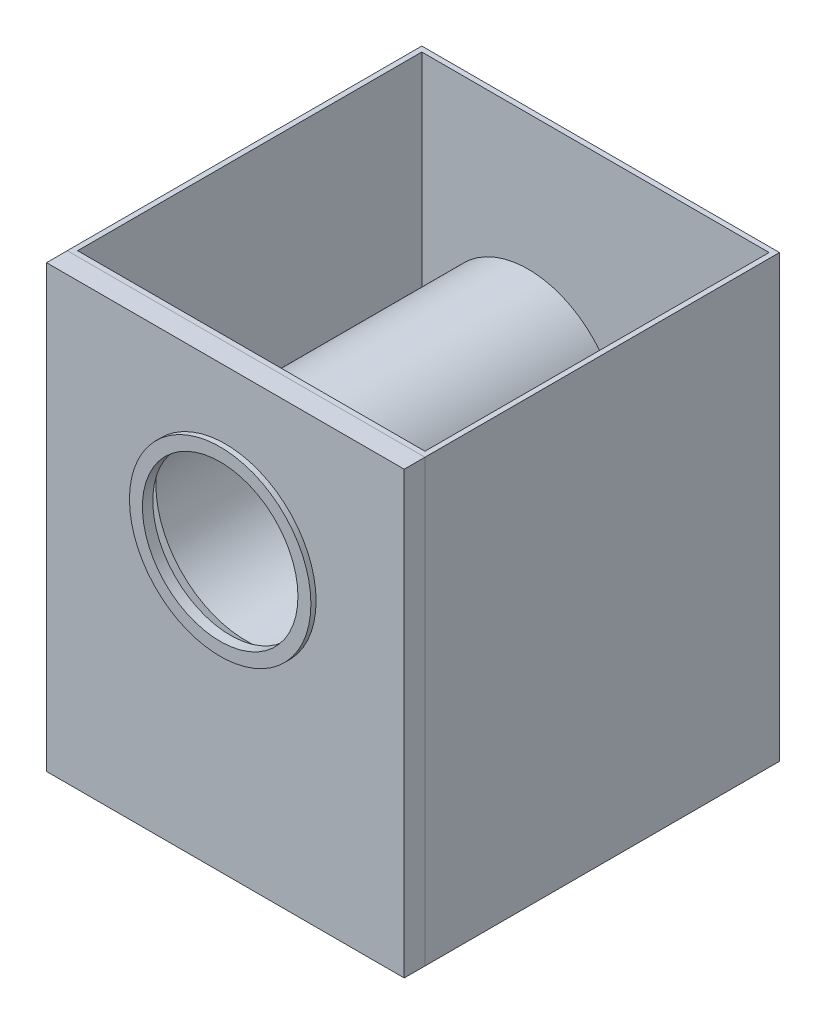
ISO-10303-21;
HEADER;
FILE_DESCRIPTION(('STEP AP214'),'2;1');
FILE_NAME('part.step','',(''),(''),'','','');
FILE_SCHEMA(('AUTOMOTIVE_DESIGN { 1 0 10303 214 1 1 1 1 }'));
ENDSEC;
DATA;
#1=APPLICATION_CONTEXT('core data for automotive mechanical design processes');
#2=APPLICATION_PROTOCOL_DEFINITION('international standard','automotive_design',2000,#1);
#3=PRODUCT_CONTEXT('',#1,'mechanical');
#4=PRODUCT('Part','Part','',(#3));
#5=PRODUCT_RELATED_PRODUCT_CATEGORY('part','',(#4));
#6=PRODUCT_DEFINITION_FORMATION('','',#4);
#7=PRODUCT_DEFINITION_CONTEXT('part definition',#1,'design');
#8=PRODUCT_DEFINITION('design','',#6,#7);
#9=PRODUCT_DEFINITION_SHAPE('','',#8);
#10=(LENGTH_UNIT() NAMED_UNIT(*) SI_UNIT(.MILLI.,.METRE.));
#11=(NAMED_UNIT(*) PLANE_ANGLE_UNIT() SI_UNIT($,.RADIAN.));
#12=(NAMED_UNIT(*) SI_UNIT($,.STERADIAN.) SOLID_ANGLE_UNIT());
#13=UNCERTAINTY_MEASURE_WITH_UNIT(LENGTH_MEASURE(1.E-05),#10,'distance_accuracy_value','');
#14=(GEOMETRIC_REPRESENTATION_CONTEXT(3) GLOBAL_UNCERTAINTY_ASSIGNED_CONTEXT((#13)) GLOBAL_UNIT_ASSIGNED_CONTEXT((#10,
#11,#12)) REPRESENTATION_CONTEXT('',''));
#15=CARTESIAN_POINT('',(0.,0.,0.));
#16=DIRECTION('',(0.,0.,1.));
#17=DIRECTION('',(1.,0.,0.));
#18=AXIS2_PLACEMENT_3D('',#15,#16,#17);
#19=CARTESIAN_POINT('',(-345.,-39.9999999999976,351.95));
#20=DIRECTION('',(-1.,0.,0.));
#21=DIRECTION('',(0.,-1.,0.));
#22=AXIS2_PLACEMENT_3D('',#19,#20,#21);
#23=PLANE('',#22);
#24=DIRECTION('',(0.,-1.,0.));
#25=VECTOR('',#24,1.);
#26=CARTESIAN_POINT('',(-345.,-39.9999999999976,361.95));
#27=LINE('',#26,#25);
#28=CARTESIAN_POINT('',(-345.,-39.9999999999976,361.95));
#29=VERTEX_POINT('',#28);
#30=CARTESIAN_POINT('',(-345.,-890.000000000003,361.95));
#31=VERTEX_POINT('',#30);
#32=EDGE_CURVE('E165',#29,#31,#27,.T.);
#33=ORIENTED_EDGE('',*,*,#32,.F.);
#34=DIRECTION('',(0.,0.,1.));
#35=VECTOR('',#34,1.);
#36=CARTESIAN_POINT('',(-345.,-39.9999999999976,351.95));
#37=LINE('',#36,#35);
#38=CARTESIAN_POINT('',(-345.,-39.9999999999977,321.95));
#39=VERTEX_POINT('',#38);
#40=EDGE_CURVE('E12',#39,#29,#37,.T.);
#41=ORIENTED_EDGE('',*,*,#40,.F.);
#42=DIRECTION('',(0.,-1.,0.));
#43=VECTOR('',#42,1.);
#44=CARTESIAN_POINT('',(-345.,-39.9999999999977,321.95));
#45=LINE('',#44,#43);
#46=CARTESIAN_POINT('',(-345.,-890.000000000003,321.95));
#47=VERTEX_POINT('',#46);
#48=EDGE_CURVE('E153',#39,#47,#45,.T.);
#49=ORIENTED_EDGE('',*,*,#48,.T.);
#50=DIRECTION('',(0.,0.,1.));
#51=VECTOR('',#50,1.);
#52=CARTESIAN_POINT('',(-345.,-890.000000000003,351.95));
#53=LINE('',#52,#51);
#54=EDGE_CURVE('E176',#47,#31,#53,.T.);
#55=ORIENTED_EDGE('',*,*,#54,.T.);
#56=EDGE_LOOP('',(#33,#41,#49,#55));
#57=FACE_BOUND('',#56,.T.);
#58=ADVANCED_FACE('F45',(#57),#23,.T.);
#59=CARTESIAN_POINT('',(-345.,-39.9999999999976,351.95));
#60=DIRECTION('',(0.,1.,0.));
#61=DIRECTION('',(0.,0.,1.));
#62=AXIS2_PLACEMENT_3D('',#59,#60,#61);
#63=PLANE('',#62);
#64=DIRECTION('',(-1.,0.,0.));
#65=VECTOR('',#64,1.);
#66=CARTESIAN_POINT('',(-345.,-39.9999999999976,361.95));
#67=LINE('',#66,#65);
#68=CARTESIAN_POINT('',(344.999999999994,-39.9999999999976,361.95));
#69=VERTEX_POINT('',#68);
#70=EDGE_CURVE('E174',#69,#29,#67,.T.);
#71=ORIENTED_EDGE('',*,*,#70,.F.);
#72=DIRECTION('',(0.,0.,1.));
#73=VECTOR('',#72,1.);
#74=CARTESIAN_POINT('',(344.999999999994,-39.9999999999976,351.95));
#75=LINE('',#74,#73);
#76=CARTESIAN_POINT('',(344.999999999994,-39.9999999999976,321.95));
#77=VERTEX_POINT('',#76);
#78=EDGE_CURVE('E53',#77,#69,#75,.T.);
#79=ORIENTED_EDGE('',*,*,#78,.F.);
#80=DIRECTION('',(-1.,0.,0.));
#81=VECTOR('',#80,1.);
#82=CARTESIAN_POINT('',(344.999999999994,-39.9999999999976,321.95));
#83=LINE('',#82,#81);
#84=EDGE_CURVE('E150',#77,#39,#83,.T.);
#85=ORIENTED_EDGE('',*,*,#84,.T.);
#86=ORIENTED_EDGE('',*,*,#40,.T.);
#87=EDGE_LOOP('',(#71,#79,#85,#86));
#88=FACE_BOUND('',#87,.T.);
#89=ADVANCED_FACE('F192',(#88),#63,.T.);
#90=CARTESIAN_POINT('',(344.999999999994,-39.9999999999976,351.95));
#91=DIRECTION('',(1.,0.,0.));
#92=DIRECTION('',(0.,1.,0.));
#93=AXIS2_PLACEMENT_3D('',#90,#91,#92);
#94=PLANE('',#93);
#95=DIRECTION('',(0.,1.,0.));
#96=VECTOR('',#95,1.);
#97=CARTESIAN_POINT('',(344.999999999994,-39.9999999999976,361.95));
#98=LINE('',#97,#96);
#99=CARTESIAN_POINT('',(344.999999999994,-890.000000000003,361.95));
#100=VERTEX_POINT('',#99);
#101=EDGE_CURVE('E171',#100,#69,#98,.T.);
#102=ORIENTED_EDGE('',*,*,#101,.F.);
#103=DIRECTION('',(0.,0.,1.));
#104=VECTOR('',#103,1.);
#105=CARTESIAN_POINT('',(344.999999999994,-890.000000000003,351.95));
#106=LINE('',#105,#104);
#107=CARTESIAN_POINT('',(344.999999999994,-890.000000000003,321.95));
#108=VERTEX_POINT('',#107);
#109=EDGE_CURVE('E179',#108,#100,#106,.T.);
#110=ORIENTED_EDGE('',*,*,#109,.F.);
#111=DIRECTION('',(0.,1.,0.));
#112=VECTOR('',#111,1.);
#113=CARTESIAN_POINT('',(344.999999999994,-39.9999999999976,321.95));
#114=LINE('',#113,#112);
#115=EDGE_CURVE('E143',#108,#77,#114,.T.);
#116=ORIENTED_EDGE('',*,*,#115,.T.);
#117=ORIENTED_EDGE('',*,*,#78,.T.);
#118=EDGE_LOOP('',(#102,#110,#116,#117));
#119=FACE_BOUND('',#118,.T.);
#120=ADVANCED_FACE('F196',(#119),#94,.T.);
#121=CARTESIAN_POINT('',(-345.,-890.000000000003,351.95));
#122=DIRECTION('',(0.,-1.,0.));
#123=DIRECTION('',(0.,0.,-1.));
#124=AXIS2_PLACEMENT_3D('',#121,#122,#123);
#125=PLANE('',#124);
#126=DIRECTION('',(1.,0.,0.));
#127=VECTOR('',#126,1.);
#128=CARTESIAN_POINT('',(-345.,-890.000000000003,361.95));
#129=LINE('',#128,#127);
#130=EDGE_CURVE('E168',#31,#100,#129,.T.);
#131=ORIENTED_EDGE('',*,*,#130,.F.);
#132=ORIENTED_EDGE('',*,*,#54,.F.);
#133=DIRECTION('',(1.,0.,0.));
#134=VECTOR('',#133,1.);
#135=CARTESIAN_POINT('',(344.999999999994,-890.000000000003,321.95));
#136=LINE('',#135,#134);
#137=EDGE_CURVE('E156',#47,#108,#136,.T.);
#138=ORIENTED_EDGE('',*,*,#137,.T.);
#139=ORIENTED_EDGE('',*,*,#109,.T.);
#140=EDGE_LOOP('',(#131,#132,#138,#139));
#141=FACE_BOUND('',#140,.T.);
#142=ADVANCED_FACE('F186',(#141),#125,.T.);
#143=CARTESIAN_POINT('',(0.,0.,361.95));
#144=DIRECTION('',(0.,0.,1.));
#145=DIRECTION('',(1.,0.,0.));
#146=AXIS2_PLACEMENT_3D('',#143,#144,#145);
#147=PLANE('',#146);
#148=CARTESIAN_POINT('',(0.,-345.199999999997,361.95));
#149=DIRECTION('',(0.,0.,1.));
#150=DIRECTION('',(1.,0.,0.));
#151=AXIS2_PLACEMENT_3D('',#148,#149,#150);
#152=CIRCLE('',#151,175.);
#153=CARTESIAN_POINT('',(175.,-345.199999999997,361.95));
#154=VERTEX_POINT('',#153);
#155=EDGE_CURVE('E135',#154,#154,#152,.T.);
#156=ORIENTED_EDGE('',*,*,#155,.F.);
#157=EDGE_LOOP('',(#156));
#158=FACE_BOUND('',#157,.T.);
#159=ORIENTED_EDGE('',*,*,#32,.T.);
#160=ORIENTED_EDGE('',*,*,#130,.T.);
#161=ORIENTED_EDGE('',*,*,#101,.T.);
#162=ORIENTED_EDGE('',*,*,#70,.T.);
#163=EDGE_LOOP('',(#159,#160,#161,#162));
#164=FACE_BOUND('',#163,.T.);
#165=ADVANCED_FACE('F189',(#158,#164),#147,.T.);
#166=CARTESIAN_POINT('',(343.999999999994,-40.9999999999976,321.95));
#167=DIRECTION('',(0.,1.,0.));
#168=DIRECTION('',(-1.,0.,0.));
#169=AXIS2_PLACEMENT_3D('',#166,#167,#168);
#170=PLANE('',#169);
#171=DIRECTION('',(0.,0.,1.));
#172=VECTOR('',#171,1.);
#173=CARTESIAN_POINT('',(343.999999999994,-40.9999999999976,321.95));
#174=LINE('',#173,#172);
#175=CARTESIAN_POINT('',(343.999999999994,-40.9999999999976,321.95));
#176=VERTEX_POINT('',#175);
#177=CARTESIAN_POINT('',(343.999999999994,-40.9999999999976,351.95));
#178=VERTEX_POINT('',#177);
#179=EDGE_CURVE('E141',#176,#178,#174,.T.);
#180=ORIENTED_EDGE('',*,*,#179,.T.);
#181=DIRECTION('',(-1.,0.,0.));
#182=VECTOR('',#181,1.);
#183=CARTESIAN_POINT('',(0.,-40.9999999999976,351.95));
#184=LINE('',#183,#182);
#185=CARTESIAN_POINT('',(-344.,-40.9999999999977,351.95));
#186=VERTEX_POINT('',#185);
#187=EDGE_CURVE('E61',#178,#186,#184,.T.);
#188=ORIENTED_EDGE('',*,*,#187,.T.);
#189=DIRECTION('',(0.,0.,1.));
#190=VECTOR('',#189,1.);
#191=CARTESIAN_POINT('',(-344.,-40.9999999999977,321.95));
#192=LINE('',#191,#190);
#193=CARTESIAN_POINT('',(-344.,-40.9999999999977,321.95));
#194=VERTEX_POINT('',#193);
#195=EDGE_CURVE('E108',#194,#186,#192,.T.);
#196=ORIENTED_EDGE('',*,*,#195,.F.);
#197=DIRECTION('',(-1.,0.,0.));
#198=VECTOR('',#197,1.);
#199=CARTESIAN_POINT('',(343.999999999994,-40.9999999999976,321.95));
#200=LINE('',#199,#198);
#201=EDGE_CURVE('E113',#176,#194,#200,.T.);
#202=ORIENTED_EDGE('',*,*,#201,.F.);
#203=EDGE_LOOP('',(#180,#188,#196,#202));
#204=FACE_BOUND('',#203,.T.);
#205=ADVANCED_FACE('F111',(#204),#170,.F.);
#206=CARTESIAN_POINT('',(343.999999999994,-40.9999999999976,321.95));
#207=DIRECTION('',(1.,0.,0.));
#208=DIRECTION('',(0.,1.,0.));
#209=AXIS2_PLACEMENT_3D('',#206,#207,#208);
#210=PLANE('',#209);
#211=DIRECTION('',(0.,0.,1.));
#212=VECTOR('',#211,1.);
#213=CARTESIAN_POINT('',(343.999999999994,-889.000000000003,321.95));
#214=LINE('',#213,#212);
#215=CARTESIAN_POINT('',(343.999999999994,-889.000000000003,321.95));
#216=VERTEX_POINT('',#215);
#217=CARTESIAN_POINT('',(343.999999999994,-889.000000000003,351.95));
#218=VERTEX_POINT('',#217);
#219=EDGE_CURVE('E144',#216,#218,#214,.T.);
#220=ORIENTED_EDGE('',*,*,#219,.T.);
#221=DIRECTION('',(0.,1.,0.));
#222=VECTOR('',#221,1.);
#223=CARTESIAN_POINT('',(343.999999999994,0.,351.95));
#224=LINE('',#223,#222);
#225=EDGE_CURVE('E65',#218,#178,#224,.T.);
#226=ORIENTED_EDGE('',*,*,#225,.T.);
#227=ORIENTED_EDGE('',*,*,#179,.F.);
#228=DIRECTION('',(0.,1.,0.));
#229=VECTOR('',#228,1.);
#230=CARTESIAN_POINT('',(343.999999999994,-40.9999999999976,321.95));
#231=LINE('',#230,#229);
#232=EDGE_CURVE('E118',#216,#176,#231,.T.);
#233=ORIENTED_EDGE('',*,*,#232,.F.);
#234=EDGE_LOOP('',(#220,#226,#227,#233));
#235=FACE_BOUND('',#234,.T.);
#236=ADVANCED_FACE('F234',(#235),#210,.F.);
#237=CARTESIAN_POINT('',(343.999999999994,-889.000000000003,321.95));
#238=DIRECTION('',(0.,-1.,0.));
#239=DIRECTION('',(1.,0.,0.));
#240=AXIS2_PLACEMENT_3D('',#237,#238,#239);
#241=PLANE('',#240);
#242=DIRECTION('',(0.,0.,1.));
#243=VECTOR('',#242,1.);
#244=CARTESIAN_POINT('',(-344.,-889.000000000003,321.95));
#245=LINE('',#244,#243);
#246=CARTESIAN_POINT('',(-344.,-889.000000000003,321.95));
#247=VERTEX_POINT('',#246);
#248=CARTESIAN_POINT('',(-344.,-889.000000000003,351.95));
#249=VERTEX_POINT('',#248);
#250=EDGE_CURVE('E117',#247,#249,#245,.T.);
#251=ORIENTED_EDGE('',*,*,#250,.T.);
#252=DIRECTION('',(1.,0.,0.));
#253=VECTOR('',#252,1.);
#254=CARTESIAN_POINT('',(1.43457597222642E-13,-889.000000000003,351.95));
#255=LINE('',#254,#253);
#256=EDGE_CURVE('E161',#249,#218,#255,.T.);
#257=ORIENTED_EDGE('',*,*,#256,.T.);
#258=ORIENTED_EDGE('',*,*,#219,.F.);
#259=DIRECTION('',(1.,0.,0.));
#260=VECTOR('',#259,1.);
#261=CARTESIAN_POINT('',(343.999999999994,-889.000000000003,321.95));
#262=LINE('',#261,#260);
#263=EDGE_CURVE('E127',#247,#216,#262,.T.);
#264=ORIENTED_EDGE('',*,*,#263,.F.);
#265=EDGE_LOOP('',(#251,#257,#258,#264));
#266=FACE_BOUND('',#265,.T.);
#267=ADVANCED_FACE('F243',(#266),#241,.F.);
#268=CARTESIAN_POINT('',(-344.,-40.9999999999977,321.95));
#269=DIRECTION('',(-1.,0.,0.));
#270=DIRECTION('',(0.,-1.,0.));
#271=AXIS2_PLACEMENT_3D('',#268,#269,#270);
#272=PLANE('',#271);
#273=ORIENTED_EDGE('',*,*,#195,.T.);
#274=DIRECTION('',(0.,-1.,0.));
#275=VECTOR('',#274,1.);
#276=CARTESIAN_POINT('',(-344.,0.,351.95));
#277=LINE('',#276,#275);
#278=EDGE_CURVE('E159',#186,#249,#277,.T.);
#279=ORIENTED_EDGE('',*,*,#278,.T.);
#280=ORIENTED_EDGE('',*,*,#250,.F.);
#281=DIRECTION('',(0.,-1.,0.));
#282=VECTOR('',#281,1.);
#283=CARTESIAN_POINT('',(-344.,-40.9999999999977,321.95));
#284=LINE('',#283,#282);
#285=EDGE_CURVE('E122',#194,#247,#284,.T.);
#286=ORIENTED_EDGE('',*,*,#285,.F.);
#287=EDGE_LOOP('',(#273,#279,#280,#286));
#288=FACE_BOUND('',#287,.T.);
#289=ADVANCED_FACE('F123',(#288),#272,.F.);
#290=CARTESIAN_POINT('',(0.,0.,321.95));
#291=DIRECTION('',(0.,0.,-1.));
#292=DIRECTION('',(-1.,0.,0.));
#293=AXIS2_PLACEMENT_3D('',#290,#291,#292);
#294=PLANE('',#293);
#295=ORIENTED_EDGE('',*,*,#201,.T.);
#296=ORIENTED_EDGE('',*,*,#285,.T.);
#297=ORIENTED_EDGE('',*,*,#263,.T.);
#298=ORIENTED_EDGE('',*,*,#232,.T.);
#299=EDGE_LOOP('',(#295,#296,#297,#298));
#300=FACE_BOUND('',#299,.T.);
#301=ORIENTED_EDGE('',*,*,#115,.F.);
#302=ORIENTED_EDGE('',*,*,#137,.F.);
#303=ORIENTED_EDGE('',*,*,#48,.F.);
#304=ORIENTED_EDGE('',*,*,#84,.F.);
#305=EDGE_LOOP('',(#301,#302,#303,#304));
#306=FACE_BOUND('',#305,.T.);
#307=ADVANCED_FACE('F129',(#300,#306),#294,.T.);
#308=CARTESIAN_POINT('',(0.,0.,351.95));
#309=DIRECTION('',(0.,0.,1.));
#310=DIRECTION('',(1.,0.,0.));
#311=AXIS2_PLACEMENT_3D('',#308,#309,#310);
#312=PLANE('',#311);
#313=CARTESIAN_POINT('',(0.,-345.199999999997,351.95));
#314=DIRECTION('',(0.,0.,1.));
#315=DIRECTION('',(1.,0.,0.));
#316=AXIS2_PLACEMENT_3D('',#313,#314,#315);
#317=CIRCLE('',#316,150.);
#318=CARTESIAN_POINT('',(150.,-345.199999999997,351.95));
#319=VERTEX_POINT('',#318);
#320=EDGE_CURVE('E48',#319,#319,#317,.T.);
#321=ORIENTED_EDGE('',*,*,#320,.T.);
#322=EDGE_LOOP('',(#321));
#323=FACE_BOUND('',#322,.T.);
#324=ORIENTED_EDGE('',*,*,#187,.F.);
#325=ORIENTED_EDGE('',*,*,#225,.F.);
#326=ORIENTED_EDGE('',*,*,#256,.F.);
#327=ORIENTED_EDGE('',*,*,#278,.F.);
#328=EDGE_LOOP('',(#324,#325,#326,#327));
#329=FACE_BOUND('',#328,.T.);
#330=ADVANCED_FACE('F270',(#323,#329),#312,.F.);
#331=CARTESIAN_POINT('',(0.,-345.199999999997,371.95));
#332=DIRECTION('',(0.,0.,1.));
#333=DIRECTION('',(1.,0.,0.));
#334=AXIS2_PLACEMENT_3D('',#331,#332,#333);
#335=PLANE('',#334);
#336=CARTESIAN_POINT('',(0.,-345.199999999997,371.95));
#337=DIRECTION('',(0.,0.,1.));
#338=DIRECTION('',(1.,0.,0.));
#339=AXIS2_PLACEMENT_3D('',#336,#337,#338);
#340=CIRCLE('',#339,175.);
#341=CARTESIAN_POINT('',(175.,-345.199999999997,371.95));
#342=VERTEX_POINT('',#341);
#343=EDGE_CURVE('E132',#342,#342,#340,.T.);
#344=ORIENTED_EDGE('',*,*,#343,.T.);
#345=EDGE_LOOP('',(#344));
#346=FACE_BOUND('',#345,.T.);
#347=CARTESIAN_POINT('',(0.,-345.199999999997,371.95));
#348=DIRECTION('',(0.,0.,1.));
#349=DIRECTION('',(1.,0.,0.));
#350=AXIS2_PLACEMENT_3D('',#347,#348,#349);
#351=CIRCLE('',#350,150.);
#352=CARTESIAN_POINT('',(150.,-345.199999999997,371.95));
#353=VERTEX_POINT('',#352);
#354=EDGE_CURVE('E327',#353,#353,#351,.T.);
#355=ORIENTED_EDGE('',*,*,#354,.F.);
#356=EDGE_LOOP('',(#355));
#357=FACE_BOUND('',#356,.T.);
#358=ADVANCED_FACE('F286',(#346,#357),#335,.T.);
#359=CARTESIAN_POINT('',(0.,-345.199999999997,371.95));
#360=DIRECTION('',(0.,0.,-1.));
#361=DIRECTION('',(-1.,0.,0.));
#362=AXIS2_PLACEMENT_3D('',#359,#360,#361);
#363=CYLINDRICAL_SURFACE('',#362,175.);
#364=ORIENTED_EDGE('',*,*,#343,.F.);
#365=EDGE_LOOP('',(#364));
#366=FACE_BOUND('',#365,.T.);
#367=ORIENTED_EDGE('',*,*,#155,.T.);
#368=EDGE_LOOP('',(#367));
#369=FACE_BOUND('',#368,.T.);
#370=ADVANCED_FACE('F290',(#366,#369),#363,.T.);
#371=CARTESIAN_POINT('',(0.,-345.199999999997,371.95));
#372=DIRECTION('',(0.,0.,-1.));
#373=DIRECTION('',(-1.,0.,0.));
#374=AXIS2_PLACEMENT_3D('',#371,#372,#373);
#375=CYLINDRICAL_SURFACE('',#374,150.);
#376=ORIENTED_EDGE('',*,*,#354,.T.);
#377=EDGE_LOOP('',(#376));
#378=FACE_BOUND('',#377,.T.);
#379=ORIENTED_EDGE('',*,*,#320,.F.);
#380=EDGE_LOOP('',(#379));
#381=FACE_BOUND('',#380,.T.);
#382=ADVANCED_FACE('F300',(#378,#381),#375,.F.);
#383=CLOSED_SHELL('',(#58,#89,#120,#142,#165,#205,#236,#267,#289,#307,#330,#358,#370,#382));
#384=MANIFOLD_SOLID_BREP('B2',#383);
#385=CARTESIAN_POINT('',(344.999999999994,-880.000000000003,-361.95));
#386=DIRECTION('',(1.,0.,0.));
#387=DIRECTION('',(0.,1.,0.));
#388=AXIS2_PLACEMENT_3D('',#385,#386,#387);
#389=PLANE('',#388);
#390=DIRECTION('',(0.,0.,1.));
#391=VECTOR('',#390,1.);
#392=CARTESIAN_POINT('',(344.999999999994,-890.000000000003,-361.95));
#393=LINE('',#392,#391);
#394=CARTESIAN_POINT('',(344.999999999994,-890.000000000003,-361.95));
#395=VERTEX_POINT('',#394);
#396=CARTESIAN_POINT('',(344.999999999994,-890.000000000003,321.95));
#397=VERTEX_POINT('',#396);
#398=EDGE_CURVE('E470',#395,#397,#393,.T.);
#399=ORIENTED_EDGE('',*,*,#398,.F.);
#400=DIRECTION('',(0.,-1.,0.));
#401=VECTOR('',#400,1.);
#402=CARTESIAN_POINT('',(344.999999999994,-880.000000000003,-361.95));
#403=LINE('',#402,#401);
#404=CARTESIAN_POINT('',(345.,-40.0000000000025,-361.95));
#405=VERTEX_POINT('',#404);
#406=EDGE_CURVE('E43',#405,#395,#403,.T.);
#407=ORIENTED_EDGE('',*,*,#406,.F.);
#408=DIRECTION('',(0.,0.,1.));
#409=VECTOR('',#408,1.);
#410=CARTESIAN_POINT('',(345.,-40.0000000000025,-361.95));
#411=LINE('',#410,#409);
#412=CARTESIAN_POINT('',(345.,-40.0000000000025,321.95));
#413=VERTEX_POINT('',#412);
#414=EDGE_CURVE('E458',#405,#413,#411,.T.);
#415=ORIENTED_EDGE('',*,*,#414,.T.);
#416=DIRECTION('',(0.,-1.,0.));
#417=VECTOR('',#416,1.);
#418=CARTESIAN_POINT('',(344.999999999994,-880.000000000003,321.95));
#419=LINE('',#418,#417);
#420=EDGE_CURVE('E353',#413,#397,#419,.T.);
#421=ORIENTED_EDGE('',*,*,#420,.T.);
#422=EDGE_LOOP('',(#399,#407,#415,#421));
#423=FACE_BOUND('',#422,.T.);
#424=ADVANCED_FACE('F350',(#423),#389,.T.);
#425=CARTESIAN_POINT('',(344.999999999994,-880.000000000003,-361.95));
#426=DIRECTION('',(0.,0.,-1.));
#427=DIRECTION('',(-1.,0.,0.));
#428=AXIS2_PLACEMENT_3D('',#425,#426,#427);
#429=PLANE('',#428);
#430=DIRECTION('',(1.,0.,0.));
#431=VECTOR('',#430,1.);
#432=CARTESIAN_POINT('',(344.999999999994,-890.000000000003,-361.95));
#433=LINE('',#432,#431);
#434=CARTESIAN_POINT('',(-345.000000000006,-889.999999999998,-361.95));
#435=VERTEX_POINT('',#434);
#436=EDGE_CURVE('E479',#435,#395,#433,.T.);
#437=ORIENTED_EDGE('',*,*,#436,.F.);
#438=DIRECTION('',(0.,-1.,0.));
#439=VECTOR('',#438,1.);
#440=CARTESIAN_POINT('',(-345.000000000006,-879.999999999998,-361.95));
#441=LINE('',#440,#439);
#442=CARTESIAN_POINT('',(-345.,-39.9999999999976,-361.95));
#443=VERTEX_POINT('',#442);
#444=EDGE_CURVE('E358',#443,#435,#441,.T.);
#445=ORIENTED_EDGE('',*,*,#444,.F.);
#446=DIRECTION('',(1.,0.,0.));
#447=VECTOR('',#446,1.);
#448=CARTESIAN_POINT('',(-345.,-39.9999999999976,-361.95));
#449=LINE('',#448,#447);
#450=EDGE_CURVE('E455',#443,#405,#449,.T.);
#451=ORIENTED_EDGE('',*,*,#450,.T.);
#452=ORIENTED_EDGE('',*,*,#406,.T.);
#453=EDGE_LOOP('',(#437,#445,#451,#452));
#454=FACE_BOUND('',#453,.T.);
#455=ADVANCED_FACE('F496',(#454),#429,.T.);
#456=CARTESIAN_POINT('',(-345.000000000006,-879.999999999998,-361.95));
#457=DIRECTION('',(-1.,0.,0.));
#458=DIRECTION('',(0.,-1.,0.));
#459=AXIS2_PLACEMENT_3D('',#456,#457,#458);
#460=PLANE('',#459);
#461=DIRECTION('',(0.,0.,-1.));
#462=VECTOR('',#461,1.);
#463=CARTESIAN_POINT('',(-345.000000000006,-889.999999999998,-361.95));
#464=LINE('',#463,#462);
#465=CARTESIAN_POINT('',(-345.000000000006,-889.999999999998,321.95));
#466=VERTEX_POINT('',#465);
#467=EDGE_CURVE('E476',#466,#435,#464,.T.);
#468=ORIENTED_EDGE('',*,*,#467,.F.);
#469=DIRECTION('',(0.,-1.,0.));
#470=VECTOR('',#469,1.);
#471=CARTESIAN_POINT('',(-345.000000000006,-879.999999999998,321.95));
#472=LINE('',#471,#470);
#473=CARTESIAN_POINT('',(-345.,-39.9999999999976,321.95));
#474=VERTEX_POINT('',#473);
#475=EDGE_CURVE('E482',#474,#466,#472,.T.);
#476=ORIENTED_EDGE('',*,*,#475,.F.);
#477=DIRECTION('',(0.,0.,-1.));
#478=VECTOR('',#477,1.);
#479=CARTESIAN_POINT('',(-345.,-39.9999999999976,-361.95));
#480=LINE('',#479,#478);
#481=EDGE_CURVE('E448',#474,#443,#480,.T.);
#482=ORIENTED_EDGE('',*,*,#481,.T.);
#483=ORIENTED_EDGE('',*,*,#444,.T.);
#484=EDGE_LOOP('',(#468,#476,#482,#483));
#485=FACE_BOUND('',#484,.T.);
#486=ADVANCED_FACE('F500',(#485),#460,.T.);
#487=CARTESIAN_POINT('',(344.999999999994,-880.000000000003,321.95));
#488=DIRECTION('',(0.,0.,1.));
#489=DIRECTION('',(1.,0.,0.));
#490=AXIS2_PLACEMENT_3D('',#487,#488,#489);
#491=PLANE('',#490);
#492=DIRECTION('',(-1.,0.,0.));
#493=VECTOR('',#492,1.);
#494=CARTESIAN_POINT('',(344.999999999994,-890.000000000003,321.95));
#495=LINE('',#494,#493);
#496=EDGE_CURVE('E473',#397,#466,#495,.T.);
#497=ORIENTED_EDGE('',*,*,#496,.F.);
#498=ORIENTED_EDGE('',*,*,#420,.F.);
#499=DIRECTION('',(-1.,0.,0.));
#500=VECTOR('',#499,1.);
#501=CARTESIAN_POINT('',(-345.,-39.9999999999976,321.95));
#502=LINE('',#501,#500);
#503=EDGE_CURVE('E461',#413,#474,#502,.T.);
#504=ORIENTED_EDGE('',*,*,#503,.T.);
#505=ORIENTED_EDGE('',*,*,#475,.T.);
#506=EDGE_LOOP('',(#497,#498,#504,#505));
#507=FACE_BOUND('',#506,.T.);
#508=CARTESIAN_POINT('',(0.,-345.199999999997,321.95));
#509=DIRECTION('',(0.,0.,1.));
#510=DIRECTION('',(1.,0.,0.));
#511=AXIS2_PLACEMENT_3D('',#508,#509,#510);
#512=CIRCLE('',#511,174.);
#513=CARTESIAN_POINT('',(174.,-345.199999999997,321.95));
#514=VERTEX_POINT('',#513);
#515=EDGE_CURVE('E630',#514,#514,#512,.T.);
#516=ORIENTED_EDGE('',*,*,#515,.F.);
#517=EDGE_LOOP('',(#516));
#518=FACE_BOUND('',#517,.T.);
#519=ADVANCED_FACE('F490',(#507,#518),#491,.T.);
#520=CARTESIAN_POINT('',(-6.30091791946683E-12,-890.,0.));
#521=DIRECTION('',(0.,-1.,0.));
#522=DIRECTION('',(1.,0.,0.));
#523=AXIS2_PLACEMENT_3D('',#520,#521,#522);
#524=PLANE('',#523);
#525=ORIENTED_EDGE('',*,*,#398,.T.);
#526=ORIENTED_EDGE('',*,*,#496,.T.);
#527=ORIENTED_EDGE('',*,*,#467,.T.);
#528=ORIENTED_EDGE('',*,*,#436,.T.);
#529=EDGE_LOOP('',(#525,#526,#527,#528));
#530=FACE_BOUND('',#529,.T.);
#531=ADVANCED_FACE('F493',(#530),#524,.T.);
#532=CARTESIAN_POINT('',(-335.,-39.9999999999977,-351.95));
#533=DIRECTION('',(0.,0.,-1.));
#534=DIRECTION('',(-1.,0.,0.));
#535=AXIS2_PLACEMENT_3D('',#532,#533,#534);
#536=PLANE('',#535);
#537=DIRECTION('',(0.,-1.,0.));
#538=VECTOR('',#537,1.);
#539=CARTESIAN_POINT('',(-335.,-39.9999999999977,-351.95));
#540=LINE('',#539,#538);
#541=CARTESIAN_POINT('',(-335.,-39.9999999999977,-351.95));
#542=VERTEX_POINT('',#541);
#543=CARTESIAN_POINT('',(-335.000000000006,-879.999999999998,-351.95));
#544=VERTEX_POINT('',#543);
#545=EDGE_CURVE('E446',#542,#544,#540,.T.);
#546=ORIENTED_EDGE('',*,*,#545,.T.);
#547=DIRECTION('',(1.,0.,0.));
#548=VECTOR('',#547,1.);
#549=CARTESIAN_POINT('',(-6.23108829268997E-12,-880.,-351.95));
#550=LINE('',#549,#548);
#551=CARTESIAN_POINT('',(334.999999999994,-880.000000000002,-351.95));
#552=VERTEX_POINT('',#551);
#553=EDGE_CURVE('E366',#544,#552,#550,.T.);
#554=ORIENTED_EDGE('',*,*,#553,.T.);
#555=DIRECTION('',(0.,-1.,0.));
#556=VECTOR('',#555,1.);
#557=CARTESIAN_POINT('',(335.,-40.0000000000024,-351.95));
#558=LINE('',#557,#556);
#559=CARTESIAN_POINT('',(335.,-40.0000000000024,-351.95));
#560=VERTEX_POINT('',#559);
#561=EDGE_CURVE('E413',#560,#552,#558,.T.);
#562=ORIENTED_EDGE('',*,*,#561,.F.);
#563=DIRECTION('',(1.,0.,0.));
#564=VECTOR('',#563,1.);
#565=CARTESIAN_POINT('',(-335.,-39.9999999999977,-351.95));
#566=LINE('',#565,#564);
#567=EDGE_CURVE('E418',#542,#560,#566,.T.);
#568=ORIENTED_EDGE('',*,*,#567,.F.);
#569=EDGE_LOOP('',(#546,#554,#562,#568));
#570=FACE_BOUND('',#569,.T.);
#571=ADVANCED_FACE('F416',(#570),#536,.F.);
#572=CARTESIAN_POINT('',(-335.,-39.9999999999977,-351.95));
#573=DIRECTION('',(-1.,0.,0.));
#574=DIRECTION('',(0.,-1.,0.));
#575=AXIS2_PLACEMENT_3D('',#572,#573,#574);
#576=PLANE('',#575);
#577=DIRECTION('',(0.,-1.,0.));
#578=VECTOR('',#577,1.);
#579=CARTESIAN_POINT('',(-335.,-39.9999999999977,311.95));
#580=LINE('',#579,#578);
#581=CARTESIAN_POINT('',(-335.,-39.9999999999977,311.95));
#582=VERTEX_POINT('',#581);
#583=CARTESIAN_POINT('',(-335.000000000006,-879.999999999998,311.95));
#584=VERTEX_POINT('',#583);
#585=EDGE_CURVE('E449',#582,#584,#580,.T.);
#586=ORIENTED_EDGE('',*,*,#585,.T.);
#587=DIRECTION('',(0.,0.,-1.));
#588=VECTOR('',#587,1.);
#589=CARTESIAN_POINT('',(-335.000000000006,-879.999999999998,0.));
#590=LINE('',#589,#588);
#591=EDGE_CURVE('E370',#584,#544,#590,.T.);
#592=ORIENTED_EDGE('',*,*,#591,.T.);
#593=ORIENTED_EDGE('',*,*,#545,.F.);
#594=DIRECTION('',(0.,0.,-1.));
#595=VECTOR('',#594,1.);
#596=CARTESIAN_POINT('',(-335.,-39.9999999999977,-351.95));
#597=LINE('',#596,#595);
#598=EDGE_CURVE('E423',#582,#542,#597,.T.);
#599=ORIENTED_EDGE('',*,*,#598,.F.);
#600=EDGE_LOOP('',(#586,#592,#593,#599));
#601=FACE_BOUND('',#600,.T.);
#602=ADVANCED_FACE('F541',(#601),#576,.F.);
#603=CARTESIAN_POINT('',(-335.,-39.9999999999977,311.95));
#604=DIRECTION('',(0.,0.,1.));
#605=DIRECTION('',(1.,0.,0.));
#606=AXIS2_PLACEMENT_3D('',#603,#604,#605);
#607=PLANE('',#606);
#608=CARTESIAN_POINT('',(0.,-345.199999999997,311.95));
#609=DIRECTION('',(0.,0.,1.));
#610=DIRECTION('',(1.,0.,0.));
#611=AXIS2_PLACEMENT_3D('',#608,#609,#610);
#612=CIRCLE('',#611,175.);
#613=CARTESIAN_POINT('',(175.,-345.199999999997,311.95));
#614=VERTEX_POINT('',#613);
#615=EDGE_CURVE('E437',#614,#614,#612,.T.);
#616=ORIENTED_EDGE('',*,*,#615,.T.);
#617=EDGE_LOOP('',(#616));
#618=FACE_BOUND('',#617,.T.);
#619=DIRECTION('',(0.,-1.,0.));
#620=VECTOR('',#619,1.);
#621=CARTESIAN_POINT('',(335.,-40.0000000000024,311.95));
#622=LINE('',#621,#620);
#623=CARTESIAN_POINT('',(335.,-40.0000000000024,311.95));
#624=VERTEX_POINT('',#623);
#625=CARTESIAN_POINT('',(334.999999999994,-880.000000000002,311.95));
#626=VERTEX_POINT('',#625);
#627=EDGE_CURVE('E422',#624,#626,#622,.T.);
#628=ORIENTED_EDGE('',*,*,#627,.T.);
#629=DIRECTION('',(-1.,0.,0.));
#630=VECTOR('',#629,1.);
#631=CARTESIAN_POINT('',(-6.28277994530666E-12,-880.,311.95));
#632=LINE('',#631,#630);
#633=EDGE_CURVE('E466',#626,#584,#632,.T.);
#634=ORIENTED_EDGE('',*,*,#633,.T.);
#635=ORIENTED_EDGE('',*,*,#585,.F.);
#636=DIRECTION('',(-1.,0.,0.));
#637=VECTOR('',#636,1.);
#638=CARTESIAN_POINT('',(-335.,-39.9999999999977,311.95));
#639=LINE('',#638,#637);
#640=EDGE_CURVE('E432',#624,#582,#639,.T.);
#641=ORIENTED_EDGE('',*,*,#640,.F.);
#642=EDGE_LOOP('',(#628,#634,#635,#641));
#643=FACE_BOUND('',#642,.T.);
#644=ADVANCED_FACE('F550',(#618,#643),#607,.F.);
#645=CARTESIAN_POINT('',(335.,-40.0000000000024,-351.95));
#646=DIRECTION('',(1.,0.,0.));
#647=DIRECTION('',(0.,1.,0.));
#648=AXIS2_PLACEMENT_3D('',#645,#646,#647);
#649=PLANE('',#648);
#650=ORIENTED_EDGE('',*,*,#561,.T.);
#651=DIRECTION('',(0.,0.,1.));
#652=VECTOR('',#651,1.);
#653=CARTESIAN_POINT('',(334.999999999994,-880.000000000002,0.));
#654=LINE('',#653,#652);
#655=EDGE_CURVE('E464',#552,#626,#654,.T.);
#656=ORIENTED_EDGE('',*,*,#655,.T.);
#657=ORIENTED_EDGE('',*,*,#627,.F.);
#658=DIRECTION('',(0.,0.,1.));
#659=VECTOR('',#658,1.);
#660=CARTESIAN_POINT('',(335.,-40.0000000000024,-351.95));
#661=LINE('',#660,#659);
#662=EDGE_CURVE('E427',#560,#624,#661,.T.);
#663=ORIENTED_EDGE('',*,*,#662,.F.);
#664=EDGE_LOOP('',(#650,#656,#657,#663));
#665=FACE_BOUND('',#664,.T.);
#666=ADVANCED_FACE('F428',(#665),#649,.F.);
#667=CARTESIAN_POINT('',(-3.65399643433505E-13,-40.,0.));
#668=DIRECTION('',(0.,1.,0.));
#669=DIRECTION('',(-1.,0.,0.));
#670=AXIS2_PLACEMENT_3D('',#667,#668,#669);
#671=PLANE('',#670);
#672=ORIENTED_EDGE('',*,*,#567,.T.);
#673=ORIENTED_EDGE('',*,*,#662,.T.);
#674=ORIENTED_EDGE('',*,*,#640,.T.);
#675=ORIENTED_EDGE('',*,*,#598,.T.);
#676=EDGE_LOOP('',(#672,#673,#674,#675));
#677=FACE_BOUND('',#676,.T.);
#678=ORIENTED_EDGE('',*,*,#481,.F.);
#679=ORIENTED_EDGE('',*,*,#503,.F.);
#680=ORIENTED_EDGE('',*,*,#414,.F.);
#681=ORIENTED_EDGE('',*,*,#450,.F.);
#682=EDGE_LOOP('',(#678,#679,#680,#681));
#683=FACE_BOUND('',#682,.T.);
#684=ADVANCED_FACE('F434',(#677,#683),#671,.T.);
#685=CARTESIAN_POINT('',(-6.23108829268997E-12,-880.,0.));
#686=DIRECTION('',(0.,-1.,0.));
#687=DIRECTION('',(1.,0.,0.));
#688=AXIS2_PLACEMENT_3D('',#685,#686,#687);
#689=PLANE('',#688);
#690=ORIENTED_EDGE('',*,*,#553,.F.);
#691=ORIENTED_EDGE('',*,*,#591,.F.);
#692=ORIENTED_EDGE('',*,*,#633,.F.);
#693=ORIENTED_EDGE('',*,*,#655,.F.);
#694=EDGE_LOOP('',(#690,#691,#692,#693));
#695=FACE_BOUND('',#694,.T.);
#696=ADVANCED_FACE('F570',(#695),#689,.F.);
#697=CARTESIAN_POINT('',(0.,-345.199999999997,-222.05));
#698=DIRECTION('',(0.,0.,1.));
#699=DIRECTION('',(1.,0.,0.));
#700=AXIS2_PLACEMENT_3D('',#697,#698,#699);
#701=CYLINDRICAL_SURFACE('',#700,175.);
#702=CARTESIAN_POINT('',(0.,-345.199999999997,-222.05));
#703=DIRECTION('',(0.,0.,1.));
#704=DIRECTION('',(1.,0.,0.));
#705=AXIS2_PLACEMENT_3D('',#702,#703,#704);
#706=CIRCLE('',#705,175.);
#707=CARTESIAN_POINT('',(175.,-345.199999999997,-222.05));
#708=VERTEX_POINT('',#707);
#709=EDGE_CURVE('E440',#708,#708,#706,.T.);
#710=ORIENTED_EDGE('',*,*,#709,.T.);
#711=EDGE_LOOP('',(#710));
#712=FACE_BOUND('',#711,.T.);
#713=ORIENTED_EDGE('',*,*,#615,.F.);
#714=EDGE_LOOP('',(#713));
#715=FACE_BOUND('',#714,.T.);
#716=ADVANCED_FACE('F579',(#712,#715),#701,.T.);
#717=CARTESIAN_POINT('',(0.,-345.199999999997,-222.05));
#718=DIRECTION('',(0.,0.,1.));
#719=DIRECTION('',(1.,0.,0.));
#720=AXIS2_PLACEMENT_3D('',#717,#718,#719);
#721=PLANE('',#720);
#722=CARTESIAN_POINT('',(0.,-345.199999999997,-222.05));
#723=DIRECTION('',(0.,0.,1.));
#724=DIRECTION('',(1.,0.,0.));
#725=AXIS2_PLACEMENT_3D('',#722,#723,#724);
#726=CIRCLE('',#725,174.);
#727=CARTESIAN_POINT('',(174.,-345.199999999997,-222.05));
#728=VERTEX_POINT('',#727);
#729=EDGE_CURVE('E627',#728,#728,#726,.T.);
#730=ORIENTED_EDGE('',*,*,#729,.T.);
#731=EDGE_LOOP('',(#730));
#732=FACE_BOUND('',#731,.T.);
#733=ORIENTED_EDGE('',*,*,#709,.F.);
#734=EDGE_LOOP('',(#733));
#735=FACE_BOUND('',#734,.T.);
#736=ADVANCED_FACE('F600',(#732,#735),#721,.F.);
#737=CARTESIAN_POINT('',(0.,-345.199999999997,-222.05));
#738=DIRECTION('',(0.,0.,1.));
#739=DIRECTION('',(1.,0.,0.));
#740=AXIS2_PLACEMENT_3D('',#737,#738,#739);
#741=CYLINDRICAL_SURFACE('',#740,174.);
#742=ORIENTED_EDGE('',*,*,#729,.F.);
#743=EDGE_LOOP('',(#742));
#744=FACE_BOUND('',#743,.T.);
#745=ORIENTED_EDGE('',*,*,#515,.T.);
#746=EDGE_LOOP('',(#745));
#747=FACE_BOUND('',#746,.T.);
#748=ADVANCED_FACE('F610',(#744,#747),#741,.F.);
#749=CLOSED_SHELL('',(#424,#455,#486,#519,#531,#571,#602,#644,#666,#684,#696,#716,#736,#748));
#750=MANIFOLD_SOLID_BREP('B6',#749);
#751=ADVANCED_BREP_SHAPE_REPRESENTATION('',(#18,#384,#750),#14);
#752=SHAPE_DEFINITION_REPRESENTATION(#9,#751);
ENDSEC;
END-ISO-10303-21;
